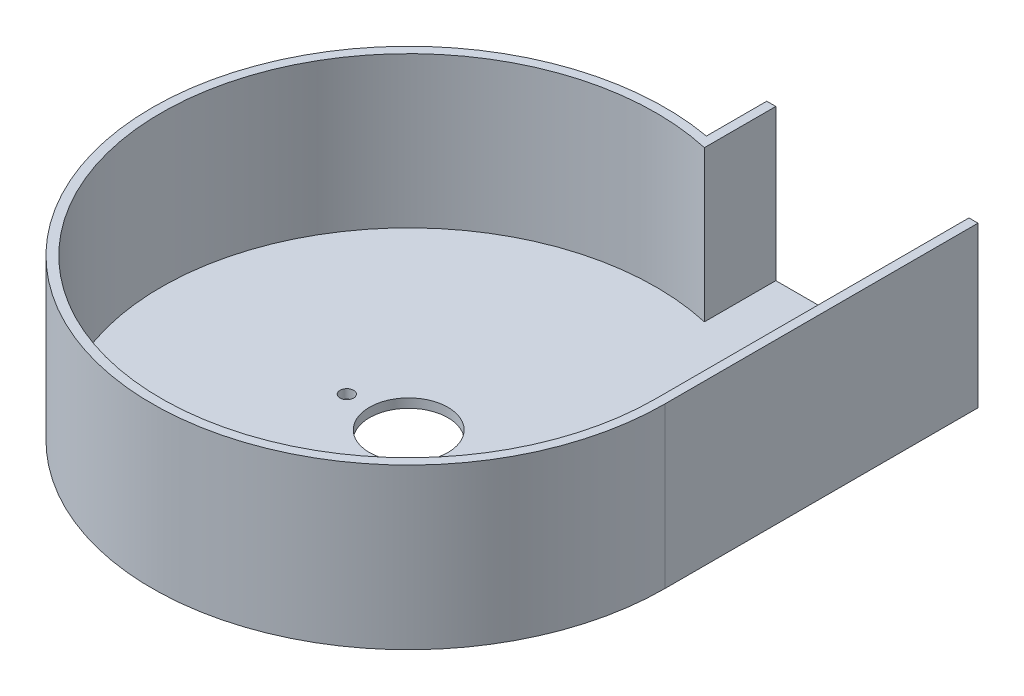
ISO-10303-21;
HEADER;
FILE_DESCRIPTION(('STEP AP214'),'2;1');
FILE_NAME('part.step','',(''),(''),'','','');
FILE_SCHEMA(('AUTOMOTIVE_DESIGN { 1 0 10303 214 1 1 1 1 }'));
ENDSEC;
DATA;
#1=APPLICATION_CONTEXT('core data for automotive mechanical design processes');
#2=APPLICATION_PROTOCOL_DEFINITION('international standard','automotive_design',2000,#1);
#3=PRODUCT_CONTEXT('',#1,'mechanical');
#4=PRODUCT('Part','Part','',(#3));
#5=PRODUCT_RELATED_PRODUCT_CATEGORY('part','',(#4));
#6=PRODUCT_DEFINITION_FORMATION('','',#4);
#7=PRODUCT_DEFINITION_CONTEXT('part definition',#1,'design');
#8=PRODUCT_DEFINITION('design','',#6,#7);
#9=PRODUCT_DEFINITION_SHAPE('','',#8);
#10=(LENGTH_UNIT() NAMED_UNIT(*) SI_UNIT(.MILLI.,.METRE.));
#11=(NAMED_UNIT(*) PLANE_ANGLE_UNIT() SI_UNIT($,.RADIAN.));
#12=(NAMED_UNIT(*) SI_UNIT($,.STERADIAN.) SOLID_ANGLE_UNIT());
#13=UNCERTAINTY_MEASURE_WITH_UNIT(LENGTH_MEASURE(1.E-05),#10,'distance_accuracy_value','');
#14=(GEOMETRIC_REPRESENTATION_CONTEXT(3) GLOBAL_UNCERTAINTY_ASSIGNED_CONTEXT((#13)) GLOBAL_UNIT_ASSIGNED_CONTEXT((#10,
#11,#12)) REPRESENTATION_CONTEXT('',''));
#15=CARTESIAN_POINT('',(0.,0.,0.));
#16=DIRECTION('',(0.,0.,1.));
#17=DIRECTION('',(1.,0.,0.));
#18=AXIS2_PLACEMENT_3D('',#15,#16,#17);
#19=CARTESIAN_POINT('',(0.,3.,0.));
#20=DIRECTION('',(0.,1.,0.));
#21=DIRECTION('',(0.,0.,1.));
#22=AXIS2_PLACEMENT_3D('',#19,#20,#21);
#23=PLANE('',#22);
#24=DIRECTION('',(0.,0.,-1.));
#25=VECTOR('',#24,1.);
#26=CARTESIAN_POINT('',(18.,3.,-103.666002653408));
#27=LINE('',#26,#25);
#28=CARTESIAN_POINT('',(18.,3.,-80.));
#29=VERTEX_POINT('',#28);
#30=CARTESIAN_POINT('',(18.,3.,-103.666002653408));
#31=VERTEX_POINT('',#30);
#32=EDGE_CURVE('E55',#29,#31,#27,.T.);
#33=ORIENTED_EDGE('',*,*,#32,.F.);
#34=CARTESIAN_POINT('',(0.,3.,0.));
#35=DIRECTION('',(0.,-1.,0.));
#36=DIRECTION('',(0.,0.,1.));
#37=AXIS2_PLACEMENT_3D('',#34,#35,#36);
#38=CIRCLE('',#37,82.);
#39=CARTESIAN_POINT('',(82.,3.,0.));
#40=VERTEX_POINT('',#39);
#41=EDGE_CURVE('E127',#40,#29,#38,.T.);
#42=ORIENTED_EDGE('',*,*,#41,.F.);
#43=DIRECTION('',(0.,0.,1.));
#44=VECTOR('',#43,1.);
#45=CARTESIAN_POINT('',(82.,3.,0.));
#46=LINE('',#45,#44);
#47=CARTESIAN_POINT('',(82.,3.,-103.666002653408));
#48=VERTEX_POINT('',#47);
#49=EDGE_CURVE('E147',#48,#40,#46,.T.);
#50=ORIENTED_EDGE('',*,*,#49,.F.);
#51=DIRECTION('',(-1.,0.,0.));
#52=VECTOR('',#51,1.);
#53=CARTESIAN_POINT('',(85.,3.,-103.666002653408));
#54=LINE('',#53,#52);
#55=EDGE_CURVE('E60',#48,#31,#54,.T.);
#56=ORIENTED_EDGE('',*,*,#55,.T.);
#57=EDGE_LOOP('',(#33,#42,#50,#56));
#58=FACE_BOUND('',#57,.T.);
#59=CARTESIAN_POINT('',(-20.5,3.,0.));
#60=DIRECTION('',(0.,1.,0.));
#61=DIRECTION('',(0.,0.,1.));
#62=AXIS2_PLACEMENT_3D('',#59,#60,#61);
#63=CIRCLE('',#62,2.25);
#64=CARTESIAN_POINT('',(-20.5,3.,2.25));
#65=VERTEX_POINT('',#64);
#66=EDGE_CURVE('E177',#65,#65,#63,.T.);
#67=ORIENTED_EDGE('',*,*,#66,.F.);
#68=EDGE_LOOP('',(#67));
#69=FACE_BOUND('',#68,.T.);
#70=CARTESIAN_POINT('',(20.5,3.,0.));
#71=DIRECTION('',(0.,1.,0.));
#72=DIRECTION('',(0.,0.,1.));
#73=AXIS2_PLACEMENT_3D('',#70,#71,#72);
#74=CIRCLE('',#73,2.25);
#75=CARTESIAN_POINT('',(20.5,3.,2.25));
#76=VERTEX_POINT('',#75);
#77=EDGE_CURVE('E185',#76,#76,#74,.T.);
#78=ORIENTED_EDGE('',*,*,#77,.F.);
#79=EDGE_LOOP('',(#78));
#80=FACE_BOUND('',#79,.T.);
#81=CARTESIAN_POINT('',(0.,3.,0.));
#82=DIRECTION('',(0.,1.,0.));
#83=DIRECTION('',(0.,0.,1.));
#84=AXIS2_PLACEMENT_3D('',#81,#82,#83);
#85=CIRCLE('',#84,13.);
#86=CARTESIAN_POINT('',(0.,3.,13.));
#87=VERTEX_POINT('',#86);
#88=EDGE_CURVE('E169',#87,#87,#85,.T.);
#89=ORIENTED_EDGE('',*,*,#88,.F.);
#90=EDGE_LOOP('',(#89));
#91=FACE_BOUND('',#90,.T.);
#92=ADVANCED_FACE('F39',(#58,#69,#80,#91),#23,.T.);
#93=CARTESIAN_POINT('',(0.,0.,0.));
#94=DIRECTION('',(0.,1.,0.));
#95=DIRECTION('',(0.,0.,1.));
#96=AXIS2_PLACEMENT_3D('',#93,#94,#95);
#97=PLANE('',#96);
#98=CARTESIAN_POINT('',(0.,0.,0.));
#99=DIRECTION('',(0.,1.,0.));
#100=DIRECTION('',(0.,0.,1.));
#101=AXIS2_PLACEMENT_3D('',#98,#99,#100);
#102=CIRCLE('',#101,85.);
#103=CARTESIAN_POINT('',(15.,0.,-83.6660026534076));
#104=VERTEX_POINT('',#103);
#105=CARTESIAN_POINT('',(85.,0.,0.));
#106=VERTEX_POINT('',#105);
#107=EDGE_CURVE('E108',#104,#106,#102,.T.);
#108=ORIENTED_EDGE('',*,*,#107,.F.);
#109=DIRECTION('',(0.,0.,1.));
#110=VECTOR('',#109,1.);
#111=CARTESIAN_POINT('',(15.,0.,-83.6660026534076));
#112=LINE('',#111,#110);
#113=CARTESIAN_POINT('',(15.,0.,-103.666002653408));
#114=VERTEX_POINT('',#113);
#115=EDGE_CURVE('E195',#114,#104,#112,.T.);
#116=ORIENTED_EDGE('',*,*,#115,.F.);
#117=DIRECTION('',(-1.,0.,0.));
#118=VECTOR('',#117,1.);
#119=CARTESIAN_POINT('',(85.,0.,-103.666002653408));
#120=LINE('',#119,#118);
#121=CARTESIAN_POINT('',(85.,0.,-103.666002653408));
#122=VERTEX_POINT('',#121);
#123=EDGE_CURVE('E201',#122,#114,#120,.T.);
#124=ORIENTED_EDGE('',*,*,#123,.F.);
#125=DIRECTION('',(0.,0.,-1.));
#126=VECTOR('',#125,1.);
#127=CARTESIAN_POINT('',(85.,0.,0.));
#128=LINE('',#127,#126);
#129=EDGE_CURVE('E198',#106,#122,#128,.T.);
#130=ORIENTED_EDGE('',*,*,#129,.F.);
#131=EDGE_LOOP('',(#108,#116,#124,#130));
#132=FACE_BOUND('',#131,.T.);
#133=CARTESIAN_POINT('',(20.5,0.,0.));
#134=DIRECTION('',(0.,1.,0.));
#135=DIRECTION('',(0.,0.,1.));
#136=AXIS2_PLACEMENT_3D('',#133,#134,#135);
#137=CIRCLE('',#136,2.25);
#138=CARTESIAN_POINT('',(20.5,0.,2.25));
#139=VERTEX_POINT('',#138);
#140=EDGE_CURVE('E181',#139,#139,#137,.T.);
#141=ORIENTED_EDGE('',*,*,#140,.T.);
#142=EDGE_LOOP('',(#141));
#143=FACE_BOUND('',#142,.T.);
#144=CARTESIAN_POINT('',(-20.5,0.,0.));
#145=DIRECTION('',(0.,1.,0.));
#146=DIRECTION('',(0.,0.,1.));
#147=AXIS2_PLACEMENT_3D('',#144,#145,#146);
#148=CIRCLE('',#147,2.25);
#149=CARTESIAN_POINT('',(-20.5,0.,2.25));
#150=VERTEX_POINT('',#149);
#151=EDGE_CURVE('E173',#150,#150,#148,.T.);
#152=ORIENTED_EDGE('',*,*,#151,.T.);
#153=EDGE_LOOP('',(#152));
#154=FACE_BOUND('',#153,.T.);
#155=CARTESIAN_POINT('',(0.,0.,0.));
#156=DIRECTION('',(0.,1.,0.));
#157=DIRECTION('',(0.,0.,1.));
#158=AXIS2_PLACEMENT_3D('',#155,#156,#157);
#159=CIRCLE('',#158,13.);
#160=CARTESIAN_POINT('',(0.,0.,13.));
#161=VERTEX_POINT('',#160);
#162=EDGE_CURVE('E168',#161,#161,#159,.T.);
#163=ORIENTED_EDGE('',*,*,#162,.T.);
#164=EDGE_LOOP('',(#163));
#165=FACE_BOUND('',#164,.T.);
#166=ADVANCED_FACE('F218',(#132,#143,#154,#165),#97,.F.);
#167=CARTESIAN_POINT('',(0.,3.,0.));
#168=DIRECTION('',(0.,-1.,0.));
#169=DIRECTION('',(0.,0.,-1.));
#170=AXIS2_PLACEMENT_3D('',#167,#168,#169);
#171=CYLINDRICAL_SURFACE('',#170,85.);
#172=ORIENTED_EDGE('',*,*,#107,.T.);
#173=DIRECTION('',(0.,-1.,0.));
#174=VECTOR('',#173,1.);
#175=CARTESIAN_POINT('',(85.,3.,0.));
#176=LINE('',#175,#174);
#177=CARTESIAN_POINT('',(85.,53.,0.));
#178=VERTEX_POINT('',#177);
#179=EDGE_CURVE('E11',#178,#106,#176,.T.);
#180=ORIENTED_EDGE('',*,*,#179,.F.);
#181=CARTESIAN_POINT('',(0.,53.,0.));
#182=DIRECTION('',(0.,1.,0.));
#183=DIRECTION('',(0.,0.,1.));
#184=AXIS2_PLACEMENT_3D('',#181,#182,#183);
#185=CIRCLE('',#184,85.);
#186=CARTESIAN_POINT('',(15.,53.,-83.6660026534076));
#187=VERTEX_POINT('',#186);
#188=EDGE_CURVE('E106',#187,#178,#185,.T.);
#189=ORIENTED_EDGE('',*,*,#188,.F.);
#190=DIRECTION('',(0.,-1.,0.));
#191=VECTOR('',#190,1.);
#192=CARTESIAN_POINT('',(15.,3.,-83.6660026534076));
#193=LINE('',#192,#191);
#194=EDGE_CURVE('E194',#187,#104,#193,.T.);
#195=ORIENTED_EDGE('',*,*,#194,.T.);
#196=EDGE_LOOP('',(#172,#180,#189,#195));
#197=FACE_BOUND('',#196,.T.);
#198=ADVANCED_FACE('F41',(#197),#171,.T.);
#199=CARTESIAN_POINT('',(85.,3.,0.));
#200=DIRECTION('',(-1.,0.,0.));
#201=DIRECTION('',(0.,0.,1.));
#202=AXIS2_PLACEMENT_3D('',#199,#200,#201);
#203=PLANE('',#202);
#204=ORIENTED_EDGE('',*,*,#129,.T.);
#205=DIRECTION('',(0.,-1.,0.));
#206=VECTOR('',#205,1.);
#207=CARTESIAN_POINT('',(85.,3.,-103.666002653408));
#208=LINE('',#207,#206);
#209=CARTESIAN_POINT('',(85.,53.,-103.666002653408));
#210=VERTEX_POINT('',#209);
#211=EDGE_CURVE('E48',#210,#122,#208,.T.);
#212=ORIENTED_EDGE('',*,*,#211,.F.);
#213=DIRECTION('',(0.,0.,-1.));
#214=VECTOR('',#213,1.);
#215=CARTESIAN_POINT('',(85.,53.,0.));
#216=LINE('',#215,#214);
#217=EDGE_CURVE('E111',#178,#210,#216,.T.);
#218=ORIENTED_EDGE('',*,*,#217,.F.);
#219=ORIENTED_EDGE('',*,*,#179,.T.);
#220=EDGE_LOOP('',(#204,#212,#218,#219));
#221=FACE_BOUND('',#220,.T.);
#222=ADVANCED_FACE('F112',(#221),#203,.F.);
#223=CARTESIAN_POINT('',(85.,3.,-103.666002653408));
#224=DIRECTION('',(0.,0.,1.));
#225=DIRECTION('',(1.,0.,0.));
#226=AXIS2_PLACEMENT_3D('',#223,#224,#225);
#227=PLANE('',#226);
#228=ORIENTED_EDGE('',*,*,#123,.T.);
#229=DIRECTION('',(0.,-1.,0.));
#230=VECTOR('',#229,1.);
#231=CARTESIAN_POINT('',(15.,3.,-103.666002653408));
#232=LINE('',#231,#230);
#233=CARTESIAN_POINT('',(15.,53.,-103.666002653408));
#234=VERTEX_POINT('',#233);
#235=EDGE_CURVE('E208',#234,#114,#232,.T.);
#236=ORIENTED_EDGE('',*,*,#235,.F.);
#237=DIRECTION('',(-1.,0.,0.));
#238=VECTOR('',#237,1.);
#239=CARTESIAN_POINT('',(15.,53.,-103.666002653408));
#240=LINE('',#239,#238);
#241=CARTESIAN_POINT('',(18.,53.,-103.666002653408));
#242=VERTEX_POINT('',#241);
#243=EDGE_CURVE('E141',#242,#234,#240,.T.);
#244=ORIENTED_EDGE('',*,*,#243,.F.);
#245=DIRECTION('',(0.,-1.,0.));
#246=VECTOR('',#245,1.);
#247=CARTESIAN_POINT('',(18.,53.,-103.666002653408));
#248=LINE('',#247,#246);
#249=EDGE_CURVE('E146',#242,#31,#248,.T.);
#250=ORIENTED_EDGE('',*,*,#249,.T.);
#251=ORIENTED_EDGE('',*,*,#55,.F.);
#252=DIRECTION('',(0.,-1.,0.));
#253=VECTOR('',#252,1.);
#254=CARTESIAN_POINT('',(82.,53.,-103.666002653408));
#255=LINE('',#254,#253);
#256=CARTESIAN_POINT('',(82.,53.,-103.666002653408));
#257=VERTEX_POINT('',#256);
#258=EDGE_CURVE('E164',#257,#48,#255,.T.);
#259=ORIENTED_EDGE('',*,*,#258,.F.);
#260=DIRECTION('',(-1.,0.,0.));
#261=VECTOR('',#260,1.);
#262=CARTESIAN_POINT('',(82.,53.,-103.666002653408));
#263=LINE('',#262,#261);
#264=EDGE_CURVE('E117',#210,#257,#263,.T.);
#265=ORIENTED_EDGE('',*,*,#264,.F.);
#266=ORIENTED_EDGE('',*,*,#211,.T.);
#267=EDGE_LOOP('',(#228,#236,#244,#250,#251,#259,#265,#266));
#268=FACE_BOUND('',#267,.T.);
#269=ADVANCED_FACE('F214',(#268),#227,.F.);
#270=CARTESIAN_POINT('',(15.,3.,-83.6660026534076));
#271=DIRECTION('',(1.,0.,0.));
#272=DIRECTION('',(0.,0.,-1.));
#273=AXIS2_PLACEMENT_3D('',#270,#271,#272);
#274=PLANE('',#273);
#275=ORIENTED_EDGE('',*,*,#115,.T.);
#276=ORIENTED_EDGE('',*,*,#194,.F.);
#277=DIRECTION('',(0.,0.,1.));
#278=VECTOR('',#277,1.);
#279=CARTESIAN_POINT('',(15.,53.,-103.666002653408));
#280=LINE('',#279,#278);
#281=EDGE_CURVE('E123',#234,#187,#280,.T.);
#282=ORIENTED_EDGE('',*,*,#281,.F.);
#283=ORIENTED_EDGE('',*,*,#235,.T.);
#284=EDGE_LOOP('',(#275,#276,#282,#283));
#285=FACE_BOUND('',#284,.T.);
#286=ADVANCED_FACE('F221',(#285),#274,.F.);
#287=CARTESIAN_POINT('',(20.5,3.,0.));
#288=DIRECTION('',(0.,-1.,0.));
#289=DIRECTION('',(0.,0.,-1.));
#290=AXIS2_PLACEMENT_3D('',#287,#288,#289);
#291=CYLINDRICAL_SURFACE('',#290,2.25);
#292=ORIENTED_EDGE('',*,*,#77,.T.);
#293=EDGE_LOOP('',(#292));
#294=FACE_BOUND('',#293,.T.);
#295=ORIENTED_EDGE('',*,*,#140,.F.);
#296=EDGE_LOOP('',(#295));
#297=FACE_BOUND('',#296,.T.);
#298=ADVANCED_FACE('F260',(#294,#297),#291,.F.);
#299=CARTESIAN_POINT('',(-20.5,3.,0.));
#300=DIRECTION('',(0.,-1.,0.));
#301=DIRECTION('',(0.,0.,-1.));
#302=AXIS2_PLACEMENT_3D('',#299,#300,#301);
#303=CYLINDRICAL_SURFACE('',#302,2.25);
#304=ORIENTED_EDGE('',*,*,#66,.T.);
#305=EDGE_LOOP('',(#304));
#306=FACE_BOUND('',#305,.T.);
#307=ORIENTED_EDGE('',*,*,#151,.F.);
#308=EDGE_LOOP('',(#307));
#309=FACE_BOUND('',#308,.T.);
#310=ADVANCED_FACE('F247',(#306,#309),#303,.F.);
#311=CARTESIAN_POINT('',(0.,3.,0.));
#312=DIRECTION('',(0.,-1.,0.));
#313=DIRECTION('',(0.,0.,-1.));
#314=AXIS2_PLACEMENT_3D('',#311,#312,#313);
#315=CYLINDRICAL_SURFACE('',#314,13.);
#316=ORIENTED_EDGE('',*,*,#88,.T.);
#317=EDGE_LOOP('',(#316));
#318=FACE_BOUND('',#317,.T.);
#319=ORIENTED_EDGE('',*,*,#162,.F.);
#320=EDGE_LOOP('',(#319));
#321=FACE_BOUND('',#320,.T.);
#322=ADVANCED_FACE('F244',(#318,#321),#315,.F.);
#323=CARTESIAN_POINT('',(82.,53.,0.));
#324=DIRECTION('',(1.,0.,0.));
#325=DIRECTION('',(0.,0.,-1.));
#326=AXIS2_PLACEMENT_3D('',#323,#324,#325);
#327=PLANE('',#326);
#328=ORIENTED_EDGE('',*,*,#49,.T.);
#329=DIRECTION('',(0.,-1.,0.));
#330=VECTOR('',#329,1.);
#331=CARTESIAN_POINT('',(82.,53.,0.));
#332=LINE('',#331,#330);
#333=CARTESIAN_POINT('',(82.,53.,0.));
#334=VERTEX_POINT('',#333);
#335=EDGE_CURVE('E160',#334,#40,#332,.T.);
#336=ORIENTED_EDGE('',*,*,#335,.F.);
#337=DIRECTION('',(0.,0.,1.));
#338=VECTOR('',#337,1.);
#339=CARTESIAN_POINT('',(82.,53.,0.));
#340=LINE('',#339,#338);
#341=EDGE_CURVE('E132',#257,#334,#340,.T.);
#342=ORIENTED_EDGE('',*,*,#341,.F.);
#343=ORIENTED_EDGE('',*,*,#258,.T.);
#344=EDGE_LOOP('',(#328,#336,#342,#343));
#345=FACE_BOUND('',#344,.T.);
#346=ADVANCED_FACE('F231',(#345),#327,.F.);
#347=CARTESIAN_POINT('',(0.,53.,0.));
#348=DIRECTION('',(0.,-1.,0.));
#349=DIRECTION('',(0.,0.,-1.));
#350=AXIS2_PLACEMENT_3D('',#347,#348,#349);
#351=CYLINDRICAL_SURFACE('',#350,82.);
#352=ORIENTED_EDGE('',*,*,#41,.T.);
#353=DIRECTION('',(0.,-1.,0.));
#354=VECTOR('',#353,1.);
#355=CARTESIAN_POINT('',(18.,53.,-80.));
#356=LINE('',#355,#354);
#357=CARTESIAN_POINT('',(18.,53.,-80.));
#358=VERTEX_POINT('',#357);
#359=EDGE_CURVE('E156',#358,#29,#356,.T.);
#360=ORIENTED_EDGE('',*,*,#359,.F.);
#361=CARTESIAN_POINT('',(0.,53.,0.));
#362=DIRECTION('',(0.,-1.,0.));
#363=DIRECTION('',(0.,0.,1.));
#364=AXIS2_PLACEMENT_3D('',#361,#362,#363);
#365=CIRCLE('',#364,82.);
#366=EDGE_CURVE('E135',#334,#358,#365,.T.);
#367=ORIENTED_EDGE('',*,*,#366,.F.);
#368=ORIENTED_EDGE('',*,*,#335,.T.);
#369=EDGE_LOOP('',(#352,#360,#367,#368));
#370=FACE_BOUND('',#369,.T.);
#371=ADVANCED_FACE('F234',(#370),#351,.F.);
#372=CARTESIAN_POINT('',(18.,53.,-103.666002653408));
#373=DIRECTION('',(-1.,0.,0.));
#374=DIRECTION('',(0.,0.,1.));
#375=AXIS2_PLACEMENT_3D('',#372,#373,#374);
#376=PLANE('',#375);
#377=ORIENTED_EDGE('',*,*,#32,.T.);
#378=ORIENTED_EDGE('',*,*,#249,.F.);
#379=DIRECTION('',(0.,0.,-1.));
#380=VECTOR('',#379,1.);
#381=CARTESIAN_POINT('',(18.,53.,-103.666002653408));
#382=LINE('',#381,#380);
#383=EDGE_CURVE('E138',#358,#242,#382,.T.);
#384=ORIENTED_EDGE('',*,*,#383,.F.);
#385=ORIENTED_EDGE('',*,*,#359,.T.);
#386=EDGE_LOOP('',(#377,#378,#384,#385));
#387=FACE_BOUND('',#386,.T.);
#388=ADVANCED_FACE('F228',(#387),#376,.F.);
#389=CARTESIAN_POINT('',(0.,53.,0.));
#390=DIRECTION('',(0.,1.,0.));
#391=DIRECTION('',(0.,0.,1.));
#392=AXIS2_PLACEMENT_3D('',#389,#390,#391);
#393=PLANE('',#392);
#394=ORIENTED_EDGE('',*,*,#188,.T.);
#395=ORIENTED_EDGE('',*,*,#217,.T.);
#396=ORIENTED_EDGE('',*,*,#264,.T.);
#397=ORIENTED_EDGE('',*,*,#341,.T.);
#398=ORIENTED_EDGE('',*,*,#366,.T.);
#399=ORIENTED_EDGE('',*,*,#383,.T.);
#400=ORIENTED_EDGE('',*,*,#243,.T.);
#401=ORIENTED_EDGE('',*,*,#281,.T.);
#402=EDGE_LOOP('',(#394,#395,#396,#397,#398,#399,#400,#401));
#403=FACE_BOUND('',#402,.T.);
#404=ADVANCED_FACE('F120',(#403),#393,.T.);
#405=CLOSED_SHELL('',(#92,#166,#198,#222,#269,#286,#298,#310,#322,#346,#371,#388,#404));
#406=MANIFOLD_SOLID_BREP('B2',#405);
#407=ADVANCED_BREP_SHAPE_REPRESENTATION('',(#18,#406),#14);
#408=SHAPE_DEFINITION_REPRESENTATION(#9,#407);
ENDSEC;
END-ISO-10303-21;
